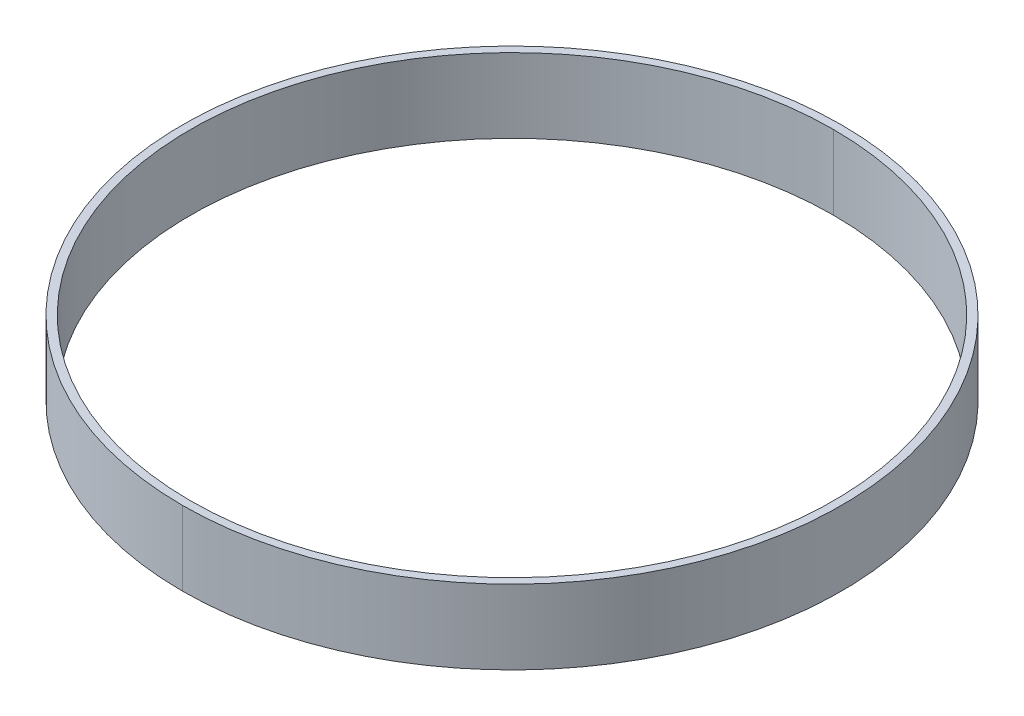
ISO-10303-21;
HEADER;
FILE_DESCRIPTION(('STEP AP214'),'2;1');
FILE_NAME('part.step','',(''),(''),'','','');
FILE_SCHEMA(('AUTOMOTIVE_DESIGN { 1 0 10303 214 1 1 1 1 }'));
ENDSEC;
DATA;
#1=APPLICATION_CONTEXT('core data for automotive mechanical design processes');
#2=APPLICATION_PROTOCOL_DEFINITION('international standard','automotive_design',2000,#1);
#3=PRODUCT_CONTEXT('',#1,'mechanical');
#4=PRODUCT('Part','Part','',(#3));
#5=PRODUCT_RELATED_PRODUCT_CATEGORY('part','',(#4));
#6=PRODUCT_DEFINITION_FORMATION('','',#4);
#7=PRODUCT_DEFINITION_CONTEXT('part definition',#1,'design');
#8=PRODUCT_DEFINITION('design','',#6,#7);
#9=PRODUCT_DEFINITION_SHAPE('','',#8);
#10=(LENGTH_UNIT() NAMED_UNIT(*) SI_UNIT(.MILLI.,.METRE.));
#11=(NAMED_UNIT(*) PLANE_ANGLE_UNIT() SI_UNIT($,.RADIAN.));
#12=(NAMED_UNIT(*) SI_UNIT($,.STERADIAN.) SOLID_ANGLE_UNIT());
#13=UNCERTAINTY_MEASURE_WITH_UNIT(LENGTH_MEASURE(1.E-05),#10,'distance_accuracy_value','');
#14=(GEOMETRIC_REPRESENTATION_CONTEXT(3) GLOBAL_UNCERTAINTY_ASSIGNED_CONTEXT((#13)) GLOBAL_UNIT_ASSIGNED_CONTEXT((#10,
#11,#12)) REPRESENTATION_CONTEXT('',''));
#15=CARTESIAN_POINT('',(0.,0.,0.));
#16=DIRECTION('',(0.,0.,1.));
#17=DIRECTION('',(1.,0.,0.));
#18=AXIS2_PLACEMENT_3D('',#15,#16,#17);
#19=CARTESIAN_POINT('',(0.,5.1,0.));
#20=DIRECTION('',(0.,-1.,0.));
#21=DIRECTION('',(0.,0.,-1.));
#22=AXIS2_PLACEMENT_3D('',#19,#20,#21);
#23=CYLINDRICAL_SURFACE('',#22,44.15);
#24=CARTESIAN_POINT('',(0.,5.1,0.));
#25=DIRECTION('',(0.,1.,0.));
#26=DIRECTION('',(0.,0.,1.));
#27=AXIS2_PLACEMENT_3D('',#24,#25,#26);
#28=CIRCLE('',#27,44.15);
#29=CARTESIAN_POINT('',(0.,5.1,-44.15));
#30=VERTEX_POINT('',#29);
#31=CARTESIAN_POINT('',(0.,5.1,44.15));
#32=VERTEX_POINT('',#31);
#33=EDGE_CURVE('E11',#30,#32,#28,.T.);
#34=ORIENTED_EDGE('',*,*,#33,.T.);
#35=DIRECTION('',(0.,-1.,0.));
#36=VECTOR('',#35,1.);
#37=CARTESIAN_POINT('',(0.,5.1,44.15));
#38=LINE('',#37,#36);
#39=CARTESIAN_POINT('',(0.,-5.1,44.15));
#40=VERTEX_POINT('',#39);
#41=EDGE_CURVE('E26',#32,#40,#38,.T.);
#42=ORIENTED_EDGE('',*,*,#41,.T.);
#43=CARTESIAN_POINT('',(0.,-5.1,0.));
#44=DIRECTION('',(0.,1.,0.));
#45=DIRECTION('',(0.,0.,1.));
#46=AXIS2_PLACEMENT_3D('',#43,#44,#45);
#47=CIRCLE('',#46,44.15);
#48=CARTESIAN_POINT('',(0.,-5.1,-44.15));
#49=VERTEX_POINT('',#48);
#50=EDGE_CURVE('E88',#49,#40,#47,.T.);
#51=ORIENTED_EDGE('',*,*,#50,.F.);
#52=DIRECTION('',(0.,-1.,0.));
#53=VECTOR('',#52,1.);
#54=CARTESIAN_POINT('',(0.,5.1,-44.15));
#55=LINE('',#54,#53);
#56=EDGE_CURVE('E111',#30,#49,#55,.T.);
#57=ORIENTED_EDGE('',*,*,#56,.F.);
#58=EDGE_LOOP('',(#34,#42,#51,#57));
#59=FACE_BOUND('',#58,.T.);
#60=ADVANCED_FACE('F16',(#59),#23,.F.);
#61=CARTESIAN_POINT('',(0.,5.1,0.));
#62=DIRECTION('',(0.,-1.,0.));
#63=DIRECTION('',(0.,0.,-1.));
#64=AXIS2_PLACEMENT_3D('',#61,#62,#63);
#65=CYLINDRICAL_SURFACE('',#64,45.25);
#66=CARTESIAN_POINT('',(0.,5.1,0.));
#67=DIRECTION('',(0.,1.,0.));
#68=DIRECTION('',(0.,0.,1.));
#69=AXIS2_PLACEMENT_3D('',#66,#67,#68);
#70=CIRCLE('',#69,45.25);
#71=CARTESIAN_POINT('',(0.,5.1,45.25));
#72=VERTEX_POINT('',#71);
#73=CARTESIAN_POINT('',(0.,5.1,-45.25));
#74=VERTEX_POINT('',#73);
#75=EDGE_CURVE('E75',#72,#74,#70,.T.);
#76=ORIENTED_EDGE('',*,*,#75,.F.);
#77=DIRECTION('',(0.,-1.,0.));
#78=VECTOR('',#77,1.);
#79=CARTESIAN_POINT('',(0.,5.1,45.25));
#80=LINE('',#79,#78);
#81=CARTESIAN_POINT('',(0.,-5.1,45.25));
#82=VERTEX_POINT('',#81);
#83=EDGE_CURVE('E91',#72,#82,#80,.T.);
#84=ORIENTED_EDGE('',*,*,#83,.T.);
#85=CARTESIAN_POINT('',(0.,-5.1,0.));
#86=DIRECTION('',(0.,1.,0.));
#87=DIRECTION('',(0.,0.,1.));
#88=AXIS2_PLACEMENT_3D('',#85,#86,#87);
#89=CIRCLE('',#88,45.25);
#90=CARTESIAN_POINT('',(0.,-5.1,-45.25));
#91=VERTEX_POINT('',#90);
#92=EDGE_CURVE('E77',#82,#91,#89,.T.);
#93=ORIENTED_EDGE('',*,*,#92,.T.);
#94=DIRECTION('',(0.,-1.,0.));
#95=VECTOR('',#94,1.);
#96=CARTESIAN_POINT('',(0.,5.1,-45.25));
#97=LINE('',#96,#95);
#98=EDGE_CURVE('E65',#74,#91,#97,.T.);
#99=ORIENTED_EDGE('',*,*,#98,.F.);
#100=EDGE_LOOP('',(#76,#84,#93,#99));
#101=FACE_BOUND('',#100,.T.);
#102=ADVANCED_FACE('F73',(#101),#65,.T.);
#103=CARTESIAN_POINT('',(0.,5.1,0.));
#104=DIRECTION('',(0.,1.,0.));
#105=DIRECTION('',(1.,0.,0.));
#106=AXIS2_PLACEMENT_3D('',#103,#104,#105);
#107=PLANE('',#106);
#108=CARTESIAN_POINT('',(0.,5.1,0.));
#109=DIRECTION('',(0.,1.,0.));
#110=DIRECTION('',(0.,0.,1.));
#111=AXIS2_PLACEMENT_3D('',#108,#109,#110);
#112=CIRCLE('',#111,45.25);
#113=EDGE_CURVE('E86',#74,#72,#112,.T.);
#114=ORIENTED_EDGE('',*,*,#113,.T.);
#115=ORIENTED_EDGE('',*,*,#75,.T.);
#116=EDGE_LOOP('',(#114,#115));
#117=FACE_BOUND('',#116,.T.);
#118=ORIENTED_EDGE('',*,*,#33,.F.);
#119=CARTESIAN_POINT('',(0.,5.1,0.));
#120=DIRECTION('',(0.,1.,0.));
#121=DIRECTION('',(0.,0.,1.));
#122=AXIS2_PLACEMENT_3D('',#119,#120,#121);
#123=CIRCLE('',#122,44.15);
#124=EDGE_CURVE('E113',#32,#30,#123,.T.);
#125=ORIENTED_EDGE('',*,*,#124,.F.);
#126=EDGE_LOOP('',(#118,#125));
#127=FACE_BOUND('',#126,.T.);
#128=ADVANCED_FACE('F84',(#117,#127),#107,.T.);
#129=CARTESIAN_POINT('',(0.,-5.1,0.));
#130=DIRECTION('',(0.,1.,0.));
#131=DIRECTION('',(1.,0.,0.));
#132=AXIS2_PLACEMENT_3D('',#129,#130,#131);
#133=PLANE('',#132);
#134=CARTESIAN_POINT('',(0.,-5.1,0.));
#135=DIRECTION('',(0.,1.,0.));
#136=DIRECTION('',(0.,0.,1.));
#137=AXIS2_PLACEMENT_3D('',#134,#135,#136);
#138=CIRCLE('',#137,45.25);
#139=EDGE_CURVE('E80',#91,#82,#138,.T.);
#140=ORIENTED_EDGE('',*,*,#139,.F.);
#141=ORIENTED_EDGE('',*,*,#92,.F.);
#142=EDGE_LOOP('',(#140,#141));
#143=FACE_BOUND('',#142,.T.);
#144=ORIENTED_EDGE('',*,*,#50,.T.);
#145=CARTESIAN_POINT('',(0.,-5.1,0.));
#146=DIRECTION('',(0.,1.,0.));
#147=DIRECTION('',(0.,0.,1.));
#148=AXIS2_PLACEMENT_3D('',#145,#146,#147);
#149=CIRCLE('',#148,44.15);
#150=EDGE_CURVE('E19',#40,#49,#149,.T.);
#151=ORIENTED_EDGE('',*,*,#150,.T.);
#152=EDGE_LOOP('',(#144,#151));
#153=FACE_BOUND('',#152,.T.);
#154=ADVANCED_FACE('F131',(#143,#153),#133,.F.);
#155=CARTESIAN_POINT('',(0.,5.1,0.));
#156=DIRECTION('',(0.,-1.,0.));
#157=DIRECTION('',(0.,0.,-1.));
#158=AXIS2_PLACEMENT_3D('',#155,#156,#157);
#159=CYLINDRICAL_SURFACE('',#158,45.25);
#160=ORIENTED_EDGE('',*,*,#83,.F.);
#161=ORIENTED_EDGE('',*,*,#113,.F.);
#162=ORIENTED_EDGE('',*,*,#98,.T.);
#163=ORIENTED_EDGE('',*,*,#139,.T.);
#164=EDGE_LOOP('',(#160,#161,#162,#163));
#165=FACE_BOUND('',#164,.T.);
#166=ADVANCED_FACE('F90',(#165),#159,.T.);
#167=CARTESIAN_POINT('',(0.,5.1,0.));
#168=DIRECTION('',(0.,-1.,0.));
#169=DIRECTION('',(0.,0.,-1.));
#170=AXIS2_PLACEMENT_3D('',#167,#168,#169);
#171=CYLINDRICAL_SURFACE('',#170,44.15);
#172=ORIENTED_EDGE('',*,*,#41,.F.);
#173=ORIENTED_EDGE('',*,*,#124,.T.);
#174=ORIENTED_EDGE('',*,*,#56,.T.);
#175=ORIENTED_EDGE('',*,*,#150,.F.);
#176=EDGE_LOOP('',(#172,#173,#174,#175));
#177=FACE_BOUND('',#176,.T.);
#178=ADVANCED_FACE('F132',(#177),#171,.F.);
#179=CLOSED_SHELL('',(#60,#102,#128,#154,#166,#178));
#180=MANIFOLD_SOLID_BREP('B1',#179);
#181=ADVANCED_BREP_SHAPE_REPRESENTATION('',(#18,#180),#14);
#182=SHAPE_DEFINITION_REPRESENTATION(#9,#181);
ENDSEC;
END-ISO-10303-21;
